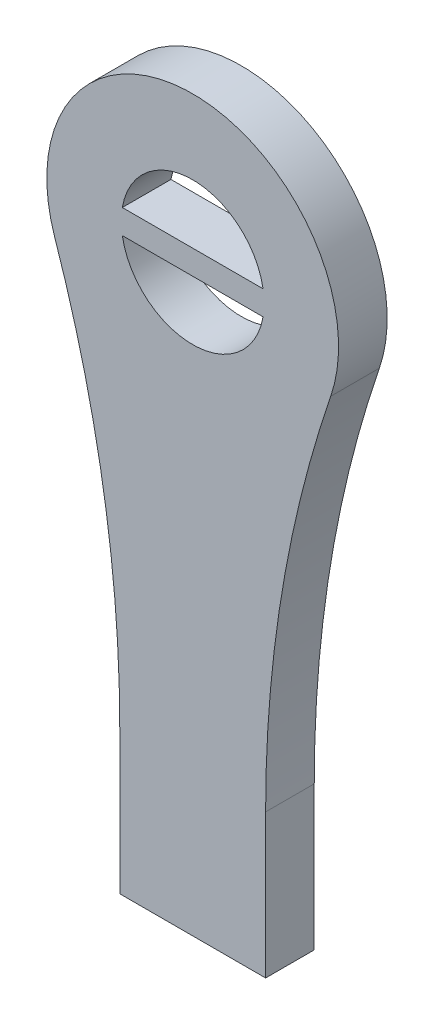
ISO-10303-21;
HEADER;
FILE_DESCRIPTION(('STEP AP214'),'2;1');
FILE_NAME('part.step','',(''),(''),'','','');
FILE_SCHEMA(('AUTOMOTIVE_DESIGN { 1 0 10303 214 1 1 1 1 }'));
ENDSEC;
DATA;
#1=APPLICATION_CONTEXT('core data for automotive mechanical design processes');
#2=APPLICATION_PROTOCOL_DEFINITION('international standard','automotive_design',2000,#1);
#3=PRODUCT_CONTEXT('',#1,'mechanical');
#4=PRODUCT('Part','Part','',(#3));
#5=PRODUCT_RELATED_PRODUCT_CATEGORY('part','',(#4));
#6=PRODUCT_DEFINITION_FORMATION('','',#4);
#7=PRODUCT_DEFINITION_CONTEXT('part definition',#1,'design');
#8=PRODUCT_DEFINITION('design','',#6,#7);
#9=PRODUCT_DEFINITION_SHAPE('','',#8);
#10=(LENGTH_UNIT() NAMED_UNIT(*) SI_UNIT(.MILLI.,.METRE.));
#11=(NAMED_UNIT(*) PLANE_ANGLE_UNIT() SI_UNIT($,.RADIAN.));
#12=(NAMED_UNIT(*) SI_UNIT($,.STERADIAN.) SOLID_ANGLE_UNIT());
#13=UNCERTAINTY_MEASURE_WITH_UNIT(LENGTH_MEASURE(1.E-05),#10,'distance_accuracy_value','');
#14=(GEOMETRIC_REPRESENTATION_CONTEXT(3) GLOBAL_UNCERTAINTY_ASSIGNED_CONTEXT((#13)) GLOBAL_UNIT_ASSIGNED_CONTEXT((#10,
#11,#12)) REPRESENTATION_CONTEXT('',''));
#15=CARTESIAN_POINT('',(0.,0.,0.));
#16=DIRECTION('',(0.,0.,1.));
#17=DIRECTION('',(1.,0.,0.));
#18=AXIS2_PLACEMENT_3D('',#15,#16,#17);
#19=CARTESIAN_POINT('',(2.08314132002572,-81.9999999999999,2.));
#20=DIRECTION('',(0.,0.,1.));
#21=DIRECTION('',(1.,0.,0.));
#22=AXIS2_PLACEMENT_3D('',#19,#20,#21);
#23=PLANE('',#22);
#24=CARTESIAN_POINT('',(2.08314132002572,-81.9999999999999,2.));
#25=DIRECTION('',(0.,0.,-1.));
#26=DIRECTION('',(1.,0.,0.));
#27=AXIS2_PLACEMENT_3D('',#24,#25,#26);
#28=CIRCLE('',#27,49.9999999999994);
#29=CARTESIAN_POINT('',(49.4045698914537,-65.8543381071205,2.));
#30=VERTEX_POINT('',#29);
#31=CARTESIAN_POINT('',(52.0831413200251,-82.0000000000001,2.));
#32=VERTEX_POINT('',#31);
#33=EDGE_CURVE('E143',#30,#32,#28,.T.);
#34=ORIENTED_EDGE('',*,*,#33,.T.);
#35=DIRECTION('',(0.,-1.,0.));
#36=VECTOR('',#35,1.);
#37=CARTESIAN_POINT('',(52.0831413200251,-87.916858679975,2.));
#38=LINE('',#37,#36);
#39=CARTESIAN_POINT('',(52.0831413200251,-87.916858679975,2.));
#40=VERTEX_POINT('',#39);
#41=EDGE_CURVE('E146',#32,#40,#38,.T.);
#42=ORIENTED_EDGE('',*,*,#41,.T.);
#43=DIRECTION('',(1.,0.,0.));
#44=VECTOR('',#43,1.);
#45=CARTESIAN_POINT('',(58.0831413200251,-87.916858679975,2.));
#46=LINE('',#45,#44);
#47=CARTESIAN_POINT('',(58.0831413200251,-87.916858679975,2.));
#48=VERTEX_POINT('',#47);
#49=EDGE_CURVE('E149',#40,#48,#46,.T.);
#50=ORIENTED_EDGE('',*,*,#49,.T.);
#51=DIRECTION('',(0.,1.,0.));
#52=VECTOR('',#51,1.);
#53=CARTESIAN_POINT('',(58.0831413200251,-82.0000000000001,2.));
#54=LINE('',#53,#52);
#55=CARTESIAN_POINT('',(58.0831413200251,-82.0000000000001,2.));
#56=VERTEX_POINT('',#55);
#57=EDGE_CURVE('E151',#48,#56,#54,.T.);
#58=ORIENTED_EDGE('',*,*,#57,.T.);
#59=CARTESIAN_POINT('',(108.083141320025,-82.0000000000002,2.));
#60=DIRECTION('',(0.,0.,-1.));
#61=DIRECTION('',(1.,0.,0.));
#62=AXIS2_PLACEMENT_3D('',#59,#60,#61);
#63=CIRCLE('',#62,50.0000000000002);
#64=CARTESIAN_POINT('',(60.7617127485965,-65.8543381071205,2.));
#65=VERTEX_POINT('',#64);
#66=EDGE_CURVE('E153',#56,#65,#63,.T.);
#67=ORIENTED_EDGE('',*,*,#66,.T.);
#68=CARTESIAN_POINT('',(55.0831413200251,-63.9168586799749,2.));
#69=DIRECTION('',(0.,0.,1.));
#70=DIRECTION('',(1.,0.,0.));
#71=AXIS2_PLACEMENT_3D('',#68,#69,#70);
#72=CIRCLE('',#71,6.00000000000001);
#73=EDGE_CURVE('E155',#65,#30,#72,.T.);
#74=ORIENTED_EDGE('',*,*,#73,.T.);
#75=EDGE_LOOP('',(#34,#42,#50,#58,#67,#74));
#76=FACE_BOUND('',#75,.T.);
#77=DIRECTION('',(-1.,0.,0.));
#78=VECTOR('',#77,1.);
#79=CARTESIAN_POINT('',(52.1885072757977,-64.416858679975,2.));
#80=LINE('',#79,#78);
#81=CARTESIAN_POINT('',(57.9777753642525,-64.416858679975,2.));
#82=VERTEX_POINT('',#81);
#83=CARTESIAN_POINT('',(52.1885072757977,-64.416858679975,2.));
#84=VERTEX_POINT('',#83);
#85=EDGE_CURVE('E129',#82,#84,#80,.T.);
#86=ORIENTED_EDGE('',*,*,#85,.F.);
#87=CARTESIAN_POINT('',(55.0831413200251,-63.9168586799749,2.));
#88=DIRECTION('',(0.,0.,1.));
#89=DIRECTION('',(1.,0.,0.));
#90=AXIS2_PLACEMENT_3D('',#87,#88,#89);
#91=CIRCLE('',#90,2.93750000000002);
#92=EDGE_CURVE('E126',#84,#82,#91,.T.);
#93=ORIENTED_EDGE('',*,*,#92,.F.);
#94=EDGE_LOOP('',(#86,#93));
#95=FACE_BOUND('',#94,.T.);
#96=DIRECTION('',(1.,0.,0.));
#97=VECTOR('',#96,1.);
#98=CARTESIAN_POINT('',(57.9777753642525,-63.416858679975,2.));
#99=LINE('',#98,#97);
#100=CARTESIAN_POINT('',(52.1885072757978,-63.416858679975,2.));
#101=VERTEX_POINT('',#100);
#102=CARTESIAN_POINT('',(57.9777753642525,-63.416858679975,2.));
#103=VERTEX_POINT('',#102);
#104=EDGE_CURVE('E109',#101,#103,#99,.T.);
#105=ORIENTED_EDGE('',*,*,#104,.F.);
#106=CARTESIAN_POINT('',(55.0831413200251,-63.9168586799749,2.));
#107=DIRECTION('',(0.,0.,1.));
#108=DIRECTION('',(1.,0.,0.));
#109=AXIS2_PLACEMENT_3D('',#106,#107,#108);
#110=CIRCLE('',#109,2.93749999999998);
#111=EDGE_CURVE('E115',#103,#101,#110,.T.);
#112=ORIENTED_EDGE('',*,*,#111,.F.);
#113=EDGE_LOOP('',(#105,#112));
#114=FACE_BOUND('',#113,.T.);
#115=ADVANCED_FACE('F33',(#76,#95,#114),#23,.T.);
#116=CARTESIAN_POINT('',(2.08314132002572,-81.9999999999999,0.));
#117=DIRECTION('',(0.,0.,1.));
#118=DIRECTION('',(1.,0.,0.));
#119=AXIS2_PLACEMENT_3D('',#116,#117,#118);
#120=PLANE('',#119);
#121=CARTESIAN_POINT('',(55.0831413200251,-63.9168586799749,0.));
#122=DIRECTION('',(0.,0.,1.));
#123=DIRECTION('',(1.,0.,0.));
#124=AXIS2_PLACEMENT_3D('',#121,#122,#123);
#125=CIRCLE('',#124,2.93750000000002);
#126=CARTESIAN_POINT('',(52.1885072757977,-64.416858679975,0.));
#127=VERTEX_POINT('',#126);
#128=CARTESIAN_POINT('',(57.9777753642525,-64.416858679975,0.));
#129=VERTEX_POINT('',#128);
#130=EDGE_CURVE('E125',#127,#129,#125,.T.);
#131=ORIENTED_EDGE('',*,*,#130,.T.);
#132=DIRECTION('',(-1.,0.,0.));
#133=VECTOR('',#132,1.);
#134=CARTESIAN_POINT('',(52.1885072757977,-64.416858679975,0.));
#135=LINE('',#134,#133);
#136=EDGE_CURVE('E130',#129,#127,#135,.T.);
#137=ORIENTED_EDGE('',*,*,#136,.T.);
#138=EDGE_LOOP('',(#131,#137));
#139=FACE_BOUND('',#138,.T.);
#140=CARTESIAN_POINT('',(2.08314132002572,-81.9999999999999,0.));
#141=DIRECTION('',(0.,0.,-1.));
#142=DIRECTION('',(1.,0.,0.));
#143=AXIS2_PLACEMENT_3D('',#140,#141,#142);
#144=CIRCLE('',#143,49.9999999999994);
#145=CARTESIAN_POINT('',(49.4045698914537,-65.8543381071205,0.));
#146=VERTEX_POINT('',#145);
#147=CARTESIAN_POINT('',(52.0831413200251,-82.0000000000001,0.));
#148=VERTEX_POINT('',#147);
#149=EDGE_CURVE('E142',#146,#148,#144,.T.);
#150=ORIENTED_EDGE('',*,*,#149,.F.);
#151=CARTESIAN_POINT('',(55.0831413200251,-63.9168586799749,0.));
#152=DIRECTION('',(0.,0.,1.));
#153=DIRECTION('',(1.,0.,0.));
#154=AXIS2_PLACEMENT_3D('',#151,#152,#153);
#155=CIRCLE('',#154,6.00000000000001);
#156=CARTESIAN_POINT('',(60.7617127485965,-65.8543381071205,0.));
#157=VERTEX_POINT('',#156);
#158=EDGE_CURVE('E147',#157,#146,#155,.T.);
#159=ORIENTED_EDGE('',*,*,#158,.F.);
#160=CARTESIAN_POINT('',(108.083141320025,-82.0000000000002,0.));
#161=DIRECTION('',(0.,0.,-1.));
#162=DIRECTION('',(1.,0.,0.));
#163=AXIS2_PLACEMENT_3D('',#160,#161,#162);
#164=CIRCLE('',#163,50.0000000000002);
#165=CARTESIAN_POINT('',(58.0831413200251,-82.0000000000001,0.));
#166=VERTEX_POINT('',#165);
#167=EDGE_CURVE('E166',#166,#157,#164,.T.);
#168=ORIENTED_EDGE('',*,*,#167,.F.);
#169=DIRECTION('',(0.,1.,0.));
#170=VECTOR('',#169,1.);
#171=CARTESIAN_POINT('',(58.0831413200251,-82.0000000000001,0.));
#172=LINE('',#171,#170);
#173=CARTESIAN_POINT('',(58.0831413200251,-87.916858679975,0.));
#174=VERTEX_POINT('',#173);
#175=EDGE_CURVE('E164',#174,#166,#172,.T.);
#176=ORIENTED_EDGE('',*,*,#175,.F.);
#177=DIRECTION('',(1.,0.,0.));
#178=VECTOR('',#177,1.);
#179=CARTESIAN_POINT('',(58.0831413200251,-87.916858679975,0.));
#180=LINE('',#179,#178);
#181=CARTESIAN_POINT('',(52.0831413200251,-87.916858679975,0.));
#182=VERTEX_POINT('',#181);
#183=EDGE_CURVE('E162',#182,#174,#180,.T.);
#184=ORIENTED_EDGE('',*,*,#183,.F.);
#185=DIRECTION('',(0.,-1.,0.));
#186=VECTOR('',#185,1.);
#187=CARTESIAN_POINT('',(52.0831413200251,-87.916858679975,0.));
#188=LINE('',#187,#186);
#189=EDGE_CURVE('E160',#148,#182,#188,.T.);
#190=ORIENTED_EDGE('',*,*,#189,.F.);
#191=EDGE_LOOP('',(#150,#159,#168,#176,#184,#190));
#192=FACE_BOUND('',#191,.T.);
#193=CARTESIAN_POINT('',(55.0831413200251,-63.9168586799749,0.));
#194=DIRECTION('',(0.,0.,1.));
#195=DIRECTION('',(1.,0.,0.));
#196=AXIS2_PLACEMENT_3D('',#193,#194,#195);
#197=CIRCLE('',#196,2.93749999999998);
#198=CARTESIAN_POINT('',(57.9777753642525,-63.416858679975,0.));
#199=VERTEX_POINT('',#198);
#200=CARTESIAN_POINT('',(52.1885072757978,-63.416858679975,0.));
#201=VERTEX_POINT('',#200);
#202=EDGE_CURVE('E55',#199,#201,#197,.T.);
#203=ORIENTED_EDGE('',*,*,#202,.T.);
#204=DIRECTION('',(1.,0.,0.));
#205=VECTOR('',#204,1.);
#206=CARTESIAN_POINT('',(57.9777753642525,-63.416858679975,0.));
#207=LINE('',#206,#205);
#208=EDGE_CURVE('E119',#201,#199,#207,.T.);
#209=ORIENTED_EDGE('',*,*,#208,.T.);
#210=EDGE_LOOP('',(#203,#209));
#211=FACE_BOUND('',#210,.T.);
#212=ADVANCED_FACE('F190',(#139,#192,#211),#120,.F.);
#213=CARTESIAN_POINT('',(2.08314132002572,-81.9999999999999,2.));
#214=DIRECTION('',(0.,0.,-1.));
#215=DIRECTION('',(-1.,0.,0.));
#216=AXIS2_PLACEMENT_3D('',#213,#214,#215);
#217=CYLINDRICAL_SURFACE('',#216,49.9999999999994);
#218=ORIENTED_EDGE('',*,*,#149,.T.);
#219=DIRECTION('',(0.,0.,-1.));
#220=VECTOR('',#219,1.);
#221=CARTESIAN_POINT('',(52.0831413200251,-82.0000000000001,2.));
#222=LINE('',#221,#220);
#223=EDGE_CURVE('E11',#32,#148,#222,.T.);
#224=ORIENTED_EDGE('',*,*,#223,.F.);
#225=ORIENTED_EDGE('',*,*,#33,.F.);
#226=DIRECTION('',(0.,0.,-1.));
#227=VECTOR('',#226,1.);
#228=CARTESIAN_POINT('',(49.4045698914537,-65.8543381071205,2.));
#229=LINE('',#228,#227);
#230=EDGE_CURVE('E157',#30,#146,#229,.T.);
#231=ORIENTED_EDGE('',*,*,#230,.T.);
#232=EDGE_LOOP('',(#218,#224,#225,#231));
#233=FACE_BOUND('',#232,.T.);
#234=ADVANCED_FACE('F35',(#233),#217,.F.);
#235=CARTESIAN_POINT('',(52.0831413200251,-87.916858679975,2.));
#236=DIRECTION('',(1.,0.,0.));
#237=DIRECTION('',(0.,1.,0.));
#238=AXIS2_PLACEMENT_3D('',#235,#236,#237);
#239=PLANE('',#238);
#240=ORIENTED_EDGE('',*,*,#189,.T.);
#241=DIRECTION('',(0.,0.,-1.));
#242=VECTOR('',#241,1.);
#243=CARTESIAN_POINT('',(52.0831413200251,-87.916858679975,2.));
#244=LINE('',#243,#242);
#245=EDGE_CURVE('E41',#40,#182,#244,.T.);
#246=ORIENTED_EDGE('',*,*,#245,.F.);
#247=ORIENTED_EDGE('',*,*,#41,.F.);
#248=ORIENTED_EDGE('',*,*,#223,.T.);
#249=EDGE_LOOP('',(#240,#246,#247,#248));
#250=FACE_BOUND('',#249,.T.);
#251=ADVANCED_FACE('F208',(#250),#239,.F.);
#252=CARTESIAN_POINT('',(58.0831413200251,-87.916858679975,2.));
#253=DIRECTION('',(0.,1.,0.));
#254=DIRECTION('',(0.,0.,1.));
#255=AXIS2_PLACEMENT_3D('',#252,#253,#254);
#256=PLANE('',#255);
#257=ORIENTED_EDGE('',*,*,#183,.T.);
#258=DIRECTION('',(0.,0.,-1.));
#259=VECTOR('',#258,1.);
#260=CARTESIAN_POINT('',(58.0831413200251,-87.916858679975,2.));
#261=LINE('',#260,#259);
#262=EDGE_CURVE('E177',#48,#174,#261,.T.);
#263=ORIENTED_EDGE('',*,*,#262,.F.);
#264=ORIENTED_EDGE('',*,*,#49,.F.);
#265=ORIENTED_EDGE('',*,*,#245,.T.);
#266=EDGE_LOOP('',(#257,#263,#264,#265));
#267=FACE_BOUND('',#266,.T.);
#268=ADVANCED_FACE('F184',(#267),#256,.F.);
#269=CARTESIAN_POINT('',(58.0831413200251,-82.0000000000001,2.));
#270=DIRECTION('',(-1.,0.,0.));
#271=DIRECTION('',(0.,0.,1.));
#272=AXIS2_PLACEMENT_3D('',#269,#270,#271);
#273=PLANE('',#272);
#274=ORIENTED_EDGE('',*,*,#175,.T.);
#275=DIRECTION('',(0.,0.,-1.));
#276=VECTOR('',#275,1.);
#277=CARTESIAN_POINT('',(58.0831413200251,-82.0000000000001,2.));
#278=LINE('',#277,#276);
#279=EDGE_CURVE('E174',#56,#166,#278,.T.);
#280=ORIENTED_EDGE('',*,*,#279,.F.);
#281=ORIENTED_EDGE('',*,*,#57,.F.);
#282=ORIENTED_EDGE('',*,*,#262,.T.);
#283=EDGE_LOOP('',(#274,#280,#281,#282));
#284=FACE_BOUND('',#283,.T.);
#285=ADVANCED_FACE('F196',(#284),#273,.F.);
#286=CARTESIAN_POINT('',(108.083141320025,-82.0000000000002,2.));
#287=DIRECTION('',(0.,0.,-1.));
#288=DIRECTION('',(-1.,0.,0.));
#289=AXIS2_PLACEMENT_3D('',#286,#287,#288);
#290=CYLINDRICAL_SURFACE('',#289,50.0000000000002);
#291=ORIENTED_EDGE('',*,*,#167,.T.);
#292=DIRECTION('',(0.,0.,-1.));
#293=VECTOR('',#292,1.);
#294=CARTESIAN_POINT('',(60.7617127485965,-65.8543381071205,2.));
#295=LINE('',#294,#293);
#296=EDGE_CURVE('E171',#65,#157,#295,.T.);
#297=ORIENTED_EDGE('',*,*,#296,.F.);
#298=ORIENTED_EDGE('',*,*,#66,.F.);
#299=ORIENTED_EDGE('',*,*,#279,.T.);
#300=EDGE_LOOP('',(#291,#297,#298,#299));
#301=FACE_BOUND('',#300,.T.);
#302=ADVANCED_FACE('F200',(#301),#290,.F.);
#303=CARTESIAN_POINT('',(55.0831413200251,-63.9168586799749,2.));
#304=DIRECTION('',(0.,0.,-1.));
#305=DIRECTION('',(-1.,0.,0.));
#306=AXIS2_PLACEMENT_3D('',#303,#304,#305);
#307=CYLINDRICAL_SURFACE('',#306,6.00000000000001);
#308=ORIENTED_EDGE('',*,*,#158,.T.);
#309=ORIENTED_EDGE('',*,*,#230,.F.);
#310=ORIENTED_EDGE('',*,*,#73,.F.);
#311=ORIENTED_EDGE('',*,*,#296,.T.);
#312=EDGE_LOOP('',(#308,#309,#310,#311));
#313=FACE_BOUND('',#312,.T.);
#314=ADVANCED_FACE('F211',(#313),#307,.T.);
#315=CARTESIAN_POINT('',(55.0831413200251,-63.9168586799749,2.));
#316=DIRECTION('',(0.,0.,-1.));
#317=DIRECTION('',(-1.,0.,0.));
#318=AXIS2_PLACEMENT_3D('',#315,#316,#317);
#319=CYLINDRICAL_SURFACE('',#318,2.93750000000002);
#320=ORIENTED_EDGE('',*,*,#130,.F.);
#321=DIRECTION('',(0.,0.,-1.));
#322=VECTOR('',#321,1.);
#323=CARTESIAN_POINT('',(52.1885072757977,-64.416858679975,2.));
#324=LINE('',#323,#322);
#325=EDGE_CURVE('E132',#84,#127,#324,.T.);
#326=ORIENTED_EDGE('',*,*,#325,.F.);
#327=ORIENTED_EDGE('',*,*,#92,.T.);
#328=DIRECTION('',(0.,0.,-1.));
#329=VECTOR('',#328,1.);
#330=CARTESIAN_POINT('',(57.9777753642525,-64.416858679975,2.));
#331=LINE('',#330,#329);
#332=EDGE_CURVE('E139',#82,#129,#331,.T.);
#333=ORIENTED_EDGE('',*,*,#332,.T.);
#334=EDGE_LOOP('',(#320,#326,#327,#333));
#335=FACE_BOUND('',#334,.T.);
#336=ADVANCED_FACE('F213',(#335),#319,.F.);
#337=CARTESIAN_POINT('',(52.1885072757977,-64.416858679975,2.));
#338=DIRECTION('',(0.,-1.,0.));
#339=DIRECTION('',(0.,0.,-1.));
#340=AXIS2_PLACEMENT_3D('',#337,#338,#339);
#341=PLANE('',#340);
#342=ORIENTED_EDGE('',*,*,#136,.F.);
#343=ORIENTED_EDGE('',*,*,#332,.F.);
#344=ORIENTED_EDGE('',*,*,#85,.T.);
#345=ORIENTED_EDGE('',*,*,#325,.T.);
#346=EDGE_LOOP('',(#342,#343,#344,#345));
#347=FACE_BOUND('',#346,.T.);
#348=ADVANCED_FACE('F219',(#347),#341,.T.);
#349=CARTESIAN_POINT('',(55.0831413200251,-63.9168586799749,2.));
#350=DIRECTION('',(0.,0.,-1.));
#351=DIRECTION('',(-1.,0.,0.));
#352=AXIS2_PLACEMENT_3D('',#349,#350,#351);
#353=CYLINDRICAL_SURFACE('',#352,2.93749999999998);
#354=ORIENTED_EDGE('',*,*,#202,.F.);
#355=DIRECTION('',(0.,0.,-1.));
#356=VECTOR('',#355,1.);
#357=CARTESIAN_POINT('',(57.9777753642525,-63.416858679975,2.));
#358=LINE('',#357,#356);
#359=EDGE_CURVE('E111',#103,#199,#358,.T.);
#360=ORIENTED_EDGE('',*,*,#359,.F.);
#361=ORIENTED_EDGE('',*,*,#111,.T.);
#362=DIRECTION('',(0.,0.,-1.));
#363=VECTOR('',#362,1.);
#364=CARTESIAN_POINT('',(52.1885072757978,-63.416858679975,2.));
#365=LINE('',#364,#363);
#366=EDGE_CURVE('E48',#101,#201,#365,.T.);
#367=ORIENTED_EDGE('',*,*,#366,.T.);
#368=EDGE_LOOP('',(#354,#360,#361,#367));
#369=FACE_BOUND('',#368,.T.);
#370=ADVANCED_FACE('F117',(#369),#353,.F.);
#371=CARTESIAN_POINT('',(57.9777753642525,-63.416858679975,2.));
#372=DIRECTION('',(0.,1.,0.));
#373=DIRECTION('',(0.,0.,1.));
#374=AXIS2_PLACEMENT_3D('',#371,#372,#373);
#375=PLANE('',#374);
#376=ORIENTED_EDGE('',*,*,#208,.F.);
#377=ORIENTED_EDGE('',*,*,#366,.F.);
#378=ORIENTED_EDGE('',*,*,#104,.T.);
#379=ORIENTED_EDGE('',*,*,#359,.T.);
#380=EDGE_LOOP('',(#376,#377,#378,#379));
#381=FACE_BOUND('',#380,.T.);
#382=ADVANCED_FACE('F110',(#381),#375,.T.);
#383=CLOSED_SHELL('',(#115,#212,#234,#251,#268,#285,#302,#314,#336,#348,#370,#382));
#384=MANIFOLD_SOLID_BREP('B2',#383);
#385=ADVANCED_BREP_SHAPE_REPRESENTATION('',(#18,#384),#14);
#386=SHAPE_DEFINITION_REPRESENTATION(#9,#385);
ENDSEC;
END-ISO-10303-21;
